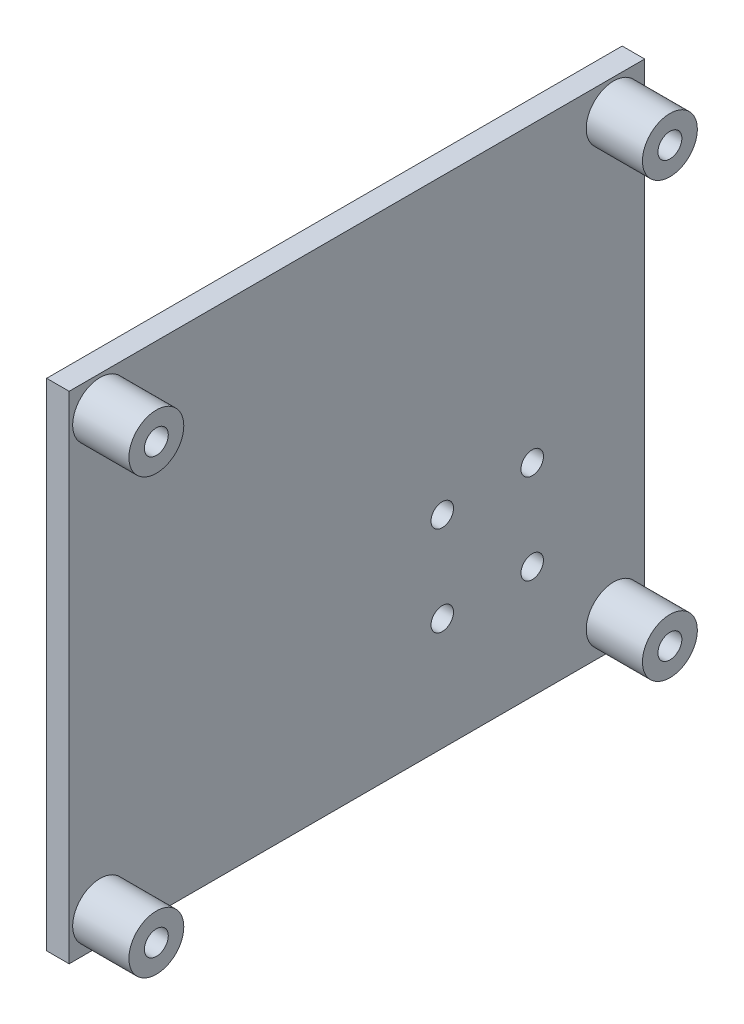
ISO-10303-21;
HEADER;
FILE_DESCRIPTION(('STEP AP214'),'2;1');
FILE_NAME('part.step','',(''),(''),'','','');
FILE_SCHEMA(('AUTOMOTIVE_DESIGN { 1 0 10303 214 1 1 1 1 }'));
ENDSEC;
DATA;
#1=APPLICATION_CONTEXT('core data for automotive mechanical design processes');
#2=APPLICATION_PROTOCOL_DEFINITION('international standard','automotive_design',2000,#1);
#3=PRODUCT_CONTEXT('',#1,'mechanical');
#4=PRODUCT('Part','Part','',(#3));
#5=PRODUCT_RELATED_PRODUCT_CATEGORY('part','',(#4));
#6=PRODUCT_DEFINITION_FORMATION('','',#4);
#7=PRODUCT_DEFINITION_CONTEXT('part definition',#1,'design');
#8=PRODUCT_DEFINITION('design','',#6,#7);
#9=PRODUCT_DEFINITION_SHAPE('','',#8);
#10=(LENGTH_UNIT() NAMED_UNIT(*) SI_UNIT(.MILLI.,.METRE.));
#11=(NAMED_UNIT(*) PLANE_ANGLE_UNIT() SI_UNIT($,.RADIAN.));
#12=(NAMED_UNIT(*) SI_UNIT($,.STERADIAN.) SOLID_ANGLE_UNIT());
#13=UNCERTAINTY_MEASURE_WITH_UNIT(LENGTH_MEASURE(1.E-05),#10,'distance_accuracy_value','');
#14=(GEOMETRIC_REPRESENTATION_CONTEXT(3) GLOBAL_UNCERTAINTY_ASSIGNED_CONTEXT((#13)) GLOBAL_UNIT_ASSIGNED_CONTEXT((#10,
#11,#12)) REPRESENTATION_CONTEXT('',''));
#15=CARTESIAN_POINT('',(0.,0.,0.));
#16=DIRECTION('',(0.,0.,1.));
#17=DIRECTION('',(1.,0.,0.));
#18=AXIS2_PLACEMENT_3D('',#15,#16,#17);
#19=CARTESIAN_POINT('',(2.54,94.3767908309456,336.103151862464));
#20=DIRECTION('',(0.,0.,-1.));
#21=DIRECTION('',(0.,1.,0.));
#22=AXIS2_PLACEMENT_3D('',#19,#20,#21);
#23=PLANE('',#22);
#24=DIRECTION('',(0.,-1.,0.));
#25=VECTOR('',#24,1.);
#26=CARTESIAN_POINT('',(0.,94.3767908309456,336.103151862464));
#27=LINE('',#26,#25);
#28=CARTESIAN_POINT('',(0.,94.3767908309456,336.103151862464));
#29=VERTEX_POINT('',#28);
#30=CARTESIAN_POINT('',(0.,38.3767908309455,336.103151862464));
#31=VERTEX_POINT('',#30);
#32=EDGE_CURVE('E100',#29,#31,#27,.T.);
#33=ORIENTED_EDGE('',*,*,#32,.T.);
#34=DIRECTION('',(-1.,0.,0.));
#35=VECTOR('',#34,1.);
#36=CARTESIAN_POINT('',(2.54,38.3767908309455,336.103151862464));
#37=LINE('',#36,#35);
#38=CARTESIAN_POINT('',(2.54,38.3767908309455,336.103151862464));
#39=VERTEX_POINT('',#38);
#40=EDGE_CURVE('E91',#39,#31,#37,.T.);
#41=ORIENTED_EDGE('',*,*,#40,.F.);
#42=DIRECTION('',(0.,-1.,0.));
#43=VECTOR('',#42,1.);
#44=CARTESIAN_POINT('',(2.54,94.3767908309456,336.103151862464));
#45=LINE('',#44,#43);
#46=CARTESIAN_POINT('',(2.54,94.3767908309456,336.103151862464));
#47=VERTEX_POINT('',#46);
#48=EDGE_CURVE('E85',#47,#39,#45,.T.);
#49=ORIENTED_EDGE('',*,*,#48,.F.);
#50=DIRECTION('',(-1.,0.,0.));
#51=VECTOR('',#50,1.);
#52=CARTESIAN_POINT('',(2.54,94.3767908309456,336.103151862464));
#53=LINE('',#52,#51);
#54=EDGE_CURVE('E96',#47,#29,#53,.T.);
#55=ORIENTED_EDGE('',*,*,#54,.T.);
#56=EDGE_LOOP('',(#33,#41,#49,#55));
#57=FACE_BOUND('',#56,.T.);
#58=ADVANCED_FACE('F33',(#57),#23,.F.);
#59=CARTESIAN_POINT('',(2.54,38.3767908309455,336.103151862464));
#60=DIRECTION('',(0.,1.,0.));
#61=DIRECTION('',(0.,0.,1.));
#62=AXIS2_PLACEMENT_3D('',#59,#60,#61);
#63=PLANE('',#62);
#64=DIRECTION('',(0.,0.,-1.));
#65=VECTOR('',#64,1.);
#66=CARTESIAN_POINT('',(0.,38.3767908309455,336.103151862464));
#67=LINE('',#66,#65);
#68=CARTESIAN_POINT('',(0.,38.3767908309456,271.103151862464));
#69=VERTEX_POINT('',#68);
#70=EDGE_CURVE('E90',#31,#69,#67,.T.);
#71=ORIENTED_EDGE('',*,*,#70,.T.);
#72=DIRECTION('',(-1.,0.,0.));
#73=VECTOR('',#72,1.);
#74=CARTESIAN_POINT('',(2.54,38.3767908309456,271.103151862464));
#75=LINE('',#74,#73);
#76=CARTESIAN_POINT('',(2.54,38.3767908309456,271.103151862464));
#77=VERTEX_POINT('',#76);
#78=EDGE_CURVE('E88',#77,#69,#75,.T.);
#79=ORIENTED_EDGE('',*,*,#78,.F.);
#80=DIRECTION('',(0.,0.,-1.));
#81=VECTOR('',#80,1.);
#82=CARTESIAN_POINT('',(2.54,38.3767908309455,336.103151862464));
#83=LINE('',#82,#81);
#84=EDGE_CURVE('E80',#39,#77,#83,.T.);
#85=ORIENTED_EDGE('',*,*,#84,.F.);
#86=ORIENTED_EDGE('',*,*,#40,.T.);
#87=EDGE_LOOP('',(#71,#79,#85,#86));
#88=FACE_BOUND('',#87,.T.);
#89=ADVANCED_FACE('F89',(#88),#63,.F.);
#90=CARTESIAN_POINT('',(2.54,94.3767908309456,271.103151862464));
#91=DIRECTION('',(0.,0.,1.));
#92=DIRECTION('',(1.,0.,0.));
#93=AXIS2_PLACEMENT_3D('',#90,#91,#92);
#94=PLANE('',#93);
#95=DIRECTION('',(0.,1.,0.));
#96=VECTOR('',#95,1.);
#97=CARTESIAN_POINT('',(0.,94.3767908309456,271.103151862464));
#98=LINE('',#97,#96);
#99=CARTESIAN_POINT('',(0.,94.3767908309456,271.103151862464));
#100=VERTEX_POINT('',#99);
#101=EDGE_CURVE('E66',#69,#100,#98,.T.);
#102=ORIENTED_EDGE('',*,*,#101,.T.);
#103=DIRECTION('',(-1.,0.,0.));
#104=VECTOR('',#103,1.);
#105=CARTESIAN_POINT('',(2.54,94.3767908309456,271.103151862464));
#106=LINE('',#105,#104);
#107=CARTESIAN_POINT('',(2.54,94.3767908309456,271.103151862464));
#108=VERTEX_POINT('',#107);
#109=EDGE_CURVE('E92',#108,#100,#106,.T.);
#110=ORIENTED_EDGE('',*,*,#109,.F.);
#111=DIRECTION('',(0.,1.,0.));
#112=VECTOR('',#111,1.);
#113=CARTESIAN_POINT('',(2.54,94.3767908309456,271.103151862464));
#114=LINE('',#113,#112);
#115=EDGE_CURVE('E83',#77,#108,#114,.T.);
#116=ORIENTED_EDGE('',*,*,#115,.F.);
#117=ORIENTED_EDGE('',*,*,#78,.T.);
#118=EDGE_LOOP('',(#102,#110,#116,#117));
#119=FACE_BOUND('',#118,.T.);
#120=ADVANCED_FACE('F94',(#119),#94,.F.);
#121=CARTESIAN_POINT('',(2.54,94.3767908309456,336.103151862464));
#122=DIRECTION('',(0.,-1.,0.));
#123=DIRECTION('',(0.,0.,-1.));
#124=AXIS2_PLACEMENT_3D('',#121,#122,#123);
#125=PLANE('',#124);
#126=DIRECTION('',(0.,0.,1.));
#127=VECTOR('',#126,1.);
#128=CARTESIAN_POINT('',(0.,94.3767908309456,336.103151862464));
#129=LINE('',#128,#127);
#130=EDGE_CURVE('E72',#100,#29,#129,.T.);
#131=ORIENTED_EDGE('',*,*,#130,.T.);
#132=ORIENTED_EDGE('',*,*,#54,.F.);
#133=DIRECTION('',(0.,0.,1.));
#134=VECTOR('',#133,1.);
#135=CARTESIAN_POINT('',(2.54,94.3767908309456,336.103151862464));
#136=LINE('',#135,#134);
#137=EDGE_CURVE('E49',#108,#47,#136,.T.);
#138=ORIENTED_EDGE('',*,*,#137,.F.);
#139=ORIENTED_EDGE('',*,*,#109,.T.);
#140=EDGE_LOOP('',(#131,#132,#138,#139));
#141=FACE_BOUND('',#140,.T.);
#142=ADVANCED_FACE('F132',(#141),#125,.F.);
#143=CARTESIAN_POINT('',(2.54,0.,0.));
#144=DIRECTION('',(1.,0.,0.));
#145=DIRECTION('',(0.,0.,-1.));
#146=AXIS2_PLACEMENT_3D('',#143,#144,#145);
#147=PLANE('',#146);
#148=CARTESIAN_POINT('',(2.54,51.0767908309455,293.963151862464));
#149=DIRECTION('',(1.,0.,0.));
#150=DIRECTION('',(0.,0.,-1.));
#151=AXIS2_PLACEMENT_3D('',#148,#149,#150);
#152=CIRCLE('',#151,1.26999999999998);
#153=CARTESIAN_POINT('',(2.54,51.0767908309455,292.693151862464));
#154=VERTEX_POINT('',#153);
#155=EDGE_CURVE('E422',#154,#154,#152,.T.);
#156=ORIENTED_EDGE('',*,*,#155,.F.);
#157=EDGE_LOOP('',(#156));
#158=FACE_BOUND('',#157,.T.);
#159=CARTESIAN_POINT('',(2.54,51.0767908309455,283.803151862464));
#160=DIRECTION('',(1.,0.,0.));
#161=DIRECTION('',(0.,0.,-1.));
#162=AXIS2_PLACEMENT_3D('',#159,#160,#161);
#163=CIRCLE('',#162,1.26999999999998);
#164=CARTESIAN_POINT('',(2.54,51.0767908309455,282.533151862464));
#165=VERTEX_POINT('',#164);
#166=EDGE_CURVE('E423',#165,#165,#163,.T.);
#167=ORIENTED_EDGE('',*,*,#166,.F.);
#168=EDGE_LOOP('',(#167));
#169=FACE_BOUND('',#168,.T.);
#170=CARTESIAN_POINT('',(2.54,61.2367908309455,293.963151862464));
#171=DIRECTION('',(1.,0.,0.));
#172=DIRECTION('',(0.,0.,-1.));
#173=AXIS2_PLACEMENT_3D('',#170,#171,#172);
#174=CIRCLE('',#173,1.26999999999998);
#175=CARTESIAN_POINT('',(2.54,61.2367908309455,292.693151862464));
#176=VERTEX_POINT('',#175);
#177=EDGE_CURVE('E426',#176,#176,#174,.T.);
#178=ORIENTED_EDGE('',*,*,#177,.F.);
#179=EDGE_LOOP('',(#178));
#180=FACE_BOUND('',#179,.T.);
#181=CARTESIAN_POINT('',(2.54,61.2367908309455,283.803151862464));
#182=DIRECTION('',(1.,0.,0.));
#183=DIRECTION('',(0.,0.,-1.));
#184=AXIS2_PLACEMENT_3D('',#181,#182,#183);
#185=CIRCLE('',#184,1.26999999999998);
#186=CARTESIAN_POINT('',(2.54,61.2367908309455,282.533151862464));
#187=VERTEX_POINT('',#186);
#188=EDGE_CURVE('E431',#187,#187,#185,.T.);
#189=ORIENTED_EDGE('',*,*,#188,.F.);
#190=EDGE_LOOP('',(#189));
#191=FACE_BOUND('',#190,.T.);
#192=CARTESIAN_POINT('',(2.54,41.8767908309455,332.603151862464));
#193=DIRECTION('',(1.,0.,0.));
#194=DIRECTION('',(0.,0.,-1.));
#195=AXIS2_PLACEMENT_3D('',#192,#193,#194);
#196=CIRCLE('',#195,3.09999999999999);
#197=CARTESIAN_POINT('',(2.54,41.8767908309455,329.503151862464));
#198=VERTEX_POINT('',#197);
#199=EDGE_CURVE('E471',#198,#198,#196,.T.);
#200=ORIENTED_EDGE('',*,*,#199,.F.);
#201=EDGE_LOOP('',(#200));
#202=FACE_BOUND('',#201,.T.);
#203=CARTESIAN_POINT('',(2.54,41.8767908309455,274.603151862464));
#204=DIRECTION('',(1.,0.,0.));
#205=DIRECTION('',(0.,0.,-1.));
#206=AXIS2_PLACEMENT_3D('',#203,#204,#205);
#207=CIRCLE('',#206,3.09999999999999);
#208=CARTESIAN_POINT('',(2.54,41.8767908309455,271.503151862464));
#209=VERTEX_POINT('',#208);
#210=EDGE_CURVE('E480',#209,#209,#207,.T.);
#211=ORIENTED_EDGE('',*,*,#210,.F.);
#212=EDGE_LOOP('',(#211));
#213=FACE_BOUND('',#212,.T.);
#214=CARTESIAN_POINT('',(2.54,90.8767908309455,274.603151862464));
#215=DIRECTION('',(1.,0.,0.));
#216=DIRECTION('',(0.,0.,-1.));
#217=AXIS2_PLACEMENT_3D('',#214,#215,#216);
#218=CIRCLE('',#217,3.09999999999999);
#219=CARTESIAN_POINT('',(2.54,90.8767908309455,271.503151862464));
#220=VERTEX_POINT('',#219);
#221=EDGE_CURVE('E489',#220,#220,#218,.T.);
#222=ORIENTED_EDGE('',*,*,#221,.F.);
#223=EDGE_LOOP('',(#222));
#224=FACE_BOUND('',#223,.T.);
#225=CARTESIAN_POINT('',(2.54,90.8767908309455,332.603151862464));
#226=DIRECTION('',(1.,0.,0.));
#227=DIRECTION('',(0.,0.,-1.));
#228=AXIS2_PLACEMENT_3D('',#225,#226,#227);
#229=CIRCLE('',#228,3.09999999999999);
#230=CARTESIAN_POINT('',(2.54,90.8767908309455,329.503151862464));
#231=VERTEX_POINT('',#230);
#232=EDGE_CURVE('E498',#231,#231,#229,.T.);
#233=ORIENTED_EDGE('',*,*,#232,.F.);
#234=EDGE_LOOP('',(#233));
#235=FACE_BOUND('',#234,.T.);
#236=ORIENTED_EDGE('',*,*,#48,.T.);
#237=ORIENTED_EDGE('',*,*,#84,.T.);
#238=ORIENTED_EDGE('',*,*,#115,.T.);
#239=ORIENTED_EDGE('',*,*,#137,.T.);
#240=EDGE_LOOP('',(#236,#237,#238,#239));
#241=FACE_BOUND('',#240,.T.);
#242=ADVANCED_FACE('F81',(#158,#169,#180,#191,#202,#213,#224,#235,#241),#147,.T.);
#243=CARTESIAN_POINT('',(0.,0.,0.));
#244=DIRECTION('',(1.,0.,0.));
#245=DIRECTION('',(0.,0.,-1.));
#246=AXIS2_PLACEMENT_3D('',#243,#244,#245);
#247=PLANE('',#246);
#248=CARTESIAN_POINT('',(0.,41.8767908309455,332.603151862464));
#249=DIRECTION('',(1.,0.,0.));
#250=DIRECTION('',(0.,0.,-1.));
#251=AXIS2_PLACEMENT_3D('',#248,#249,#250);
#252=CIRCLE('',#251,1.35000000000001);
#253=CARTESIAN_POINT('',(0.,41.8767908309455,331.253151862464));
#254=VERTEX_POINT('',#253);
#255=EDGE_CURVE('E434',#254,#254,#252,.T.);
#256=ORIENTED_EDGE('',*,*,#255,.T.);
#257=EDGE_LOOP('',(#256));
#258=FACE_BOUND('',#257,.T.);
#259=CARTESIAN_POINT('',(0.,41.8767908309455,274.603151862464));
#260=DIRECTION('',(1.,0.,0.));
#261=DIRECTION('',(0.,0.,-1.));
#262=AXIS2_PLACEMENT_3D('',#259,#260,#261);
#263=CIRCLE('',#262,1.35000000000001);
#264=CARTESIAN_POINT('',(0.,41.8767908309455,273.253151862464));
#265=VERTEX_POINT('',#264);
#266=EDGE_CURVE('E437',#265,#265,#263,.T.);
#267=ORIENTED_EDGE('',*,*,#266,.T.);
#268=EDGE_LOOP('',(#267));
#269=FACE_BOUND('',#268,.T.);
#270=CARTESIAN_POINT('',(0.,90.8767908309455,274.603151862464));
#271=DIRECTION('',(1.,0.,0.));
#272=DIRECTION('',(0.,0.,-1.));
#273=AXIS2_PLACEMENT_3D('',#270,#271,#272);
#274=CIRCLE('',#273,1.35000000000001);
#275=CARTESIAN_POINT('',(0.,90.8767908309455,273.253151862464));
#276=VERTEX_POINT('',#275);
#277=EDGE_CURVE('E440',#276,#276,#274,.T.);
#278=ORIENTED_EDGE('',*,*,#277,.T.);
#279=EDGE_LOOP('',(#278));
#280=FACE_BOUND('',#279,.T.);
#281=CARTESIAN_POINT('',(0.,90.8767908309455,332.603151862464));
#282=DIRECTION('',(1.,0.,0.));
#283=DIRECTION('',(0.,0.,-1.));
#284=AXIS2_PLACEMENT_3D('',#281,#282,#283);
#285=CIRCLE('',#284,1.34999996700003);
#286=CARTESIAN_POINT('',(0.,90.8767908309455,331.253151895464));
#287=VERTEX_POINT('',#286);
#288=EDGE_CURVE('E443',#287,#287,#285,.T.);
#289=ORIENTED_EDGE('',*,*,#288,.T.);
#290=EDGE_LOOP('',(#289));
#291=FACE_BOUND('',#290,.T.);
#292=CARTESIAN_POINT('',(0.,51.0767908309455,293.963151862464));
#293=DIRECTION('',(1.,0.,0.));
#294=DIRECTION('',(0.,0.,-1.));
#295=AXIS2_PLACEMENT_3D('',#292,#293,#294);
#296=CIRCLE('',#295,2.54000000000001);
#297=CARTESIAN_POINT('',(0.,51.0767908309455,291.423151862464));
#298=VERTEX_POINT('',#297);
#299=EDGE_CURVE('E11',#298,#298,#296,.F.);
#300=ORIENTED_EDGE('',*,*,#299,.F.);
#301=EDGE_LOOP('',(#300));
#302=FACE_BOUND('',#301,.T.);
#303=CARTESIAN_POINT('',(0.,51.0767908309455,283.803151862464));
#304=DIRECTION('',(1.,0.,0.));
#305=DIRECTION('',(0.,0.,-1.));
#306=AXIS2_PLACEMENT_3D('',#303,#304,#305);
#307=CIRCLE('',#306,2.54000000000001);
#308=CARTESIAN_POINT('',(0.,51.0767908309455,281.263151862464));
#309=VERTEX_POINT('',#308);
#310=EDGE_CURVE('E41',#309,#309,#307,.F.);
#311=ORIENTED_EDGE('',*,*,#310,.F.);
#312=EDGE_LOOP('',(#311));
#313=FACE_BOUND('',#312,.T.);
#314=CARTESIAN_POINT('',(0.,61.2367908309455,293.963151862464));
#315=DIRECTION('',(1.,0.,0.));
#316=DIRECTION('',(0.,0.,-1.));
#317=AXIS2_PLACEMENT_3D('',#314,#315,#316);
#318=CIRCLE('',#317,2.54000000000001);
#319=CARTESIAN_POINT('',(0.,61.2367908309455,291.423151862464));
#320=VERTEX_POINT('',#319);
#321=EDGE_CURVE('E113',#320,#320,#318,.F.);
#322=ORIENTED_EDGE('',*,*,#321,.F.);
#323=EDGE_LOOP('',(#322));
#324=FACE_BOUND('',#323,.T.);
#325=CARTESIAN_POINT('',(0.,61.2367908309455,283.803151862464));
#326=DIRECTION('',(1.,0.,0.));
#327=DIRECTION('',(0.,0.,-1.));
#328=AXIS2_PLACEMENT_3D('',#325,#326,#327);
#329=CIRCLE('',#328,2.54000000000001);
#330=CARTESIAN_POINT('',(0.,61.2367908309455,281.263151862464));
#331=VERTEX_POINT('',#330);
#332=EDGE_CURVE('E110',#331,#331,#329,.F.);
#333=ORIENTED_EDGE('',*,*,#332,.F.);
#334=EDGE_LOOP('',(#333));
#335=FACE_BOUND('',#334,.T.);
#336=ORIENTED_EDGE('',*,*,#32,.F.);
#337=ORIENTED_EDGE('',*,*,#130,.F.);
#338=ORIENTED_EDGE('',*,*,#101,.F.);
#339=ORIENTED_EDGE('',*,*,#70,.F.);
#340=EDGE_LOOP('',(#336,#337,#338,#339));
#341=FACE_BOUND('',#340,.T.);
#342=ADVANCED_FACE('F120',(#258,#269,#280,#291,#302,#313,#324,#335,#341),#247,.F.);
#343=CARTESIAN_POINT('',(8.89,90.8767908309455,332.603151862464));
#344=DIRECTION('',(1.,0.,0.));
#345=DIRECTION('',(0.,0.,-1.));
#346=AXIS2_PLACEMENT_3D('',#343,#344,#345);
#347=PLANE('',#346);
#348=CARTESIAN_POINT('',(8.89,90.8767908309455,332.603151862464));
#349=DIRECTION('',(1.,0.,0.));
#350=DIRECTION('',(0.,0.,-1.));
#351=AXIS2_PLACEMENT_3D('',#348,#349,#350);
#352=CIRCLE('',#351,3.09999999999999);
#353=CARTESIAN_POINT('',(8.89,90.8767908309455,329.503151862464));
#354=VERTEX_POINT('',#353);
#355=EDGE_CURVE('E103',#354,#354,#352,.T.);
#356=ORIENTED_EDGE('',*,*,#355,.T.);
#357=EDGE_LOOP('',(#356));
#358=FACE_BOUND('',#357,.T.);
#359=CARTESIAN_POINT('',(8.89,90.8767908309455,332.603151862464));
#360=DIRECTION('',(1.,0.,0.));
#361=DIRECTION('',(0.,0.,-1.));
#362=AXIS2_PLACEMENT_3D('',#359,#360,#361);
#363=CIRCLE('',#362,1.34999996700003);
#364=CARTESIAN_POINT('',(8.89,90.8767908309455,331.253151895464));
#365=VERTEX_POINT('',#364);
#366=EDGE_CURVE('E493',#365,#365,#363,.T.);
#367=ORIENTED_EDGE('',*,*,#366,.F.);
#368=EDGE_LOOP('',(#367));
#369=FACE_BOUND('',#368,.T.);
#370=ADVANCED_FACE('F123',(#358,#369),#347,.T.);
#371=CARTESIAN_POINT('',(8.89,90.8767908309455,332.603151862464));
#372=DIRECTION('',(-1.,0.,0.));
#373=DIRECTION('',(0.,0.,1.));
#374=AXIS2_PLACEMENT_3D('',#371,#372,#373);
#375=CYLINDRICAL_SURFACE('',#374,3.09999999999999);
#376=ORIENTED_EDGE('',*,*,#355,.F.);
#377=EDGE_LOOP('',(#376));
#378=FACE_BOUND('',#377,.T.);
#379=ORIENTED_EDGE('',*,*,#232,.T.);
#380=EDGE_LOOP('',(#379));
#381=FACE_BOUND('',#380,.T.);
#382=ADVANCED_FACE('F167',(#378,#381),#375,.T.);
#383=CARTESIAN_POINT('',(8.89,90.8767908309455,332.603151862464));
#384=DIRECTION('',(-1.,0.,0.));
#385=DIRECTION('',(0.,0.,1.));
#386=AXIS2_PLACEMENT_3D('',#383,#384,#385);
#387=CYLINDRICAL_SURFACE('',#386,1.34999996700003);
#388=ORIENTED_EDGE('',*,*,#366,.T.);
#389=EDGE_LOOP('',(#388));
#390=FACE_BOUND('',#389,.T.);
#391=ORIENTED_EDGE('',*,*,#288,.F.);
#392=EDGE_LOOP('',(#391));
#393=FACE_BOUND('',#392,.T.);
#394=ADVANCED_FACE('F179',(#390,#393),#387,.F.);
#395=CARTESIAN_POINT('',(8.89,90.8767908309455,274.603151862464));
#396=DIRECTION('',(1.,0.,0.));
#397=DIRECTION('',(0.,0.,-1.));
#398=AXIS2_PLACEMENT_3D('',#395,#396,#397);
#399=PLANE('',#398);
#400=CARTESIAN_POINT('',(8.89,90.8767908309455,274.603151862464));
#401=DIRECTION('',(1.,0.,0.));
#402=DIRECTION('',(0.,0.,-1.));
#403=AXIS2_PLACEMENT_3D('',#400,#401,#402);
#404=CIRCLE('',#403,3.09999999999999);
#405=CARTESIAN_POINT('',(8.89,90.8767908309455,271.503151862464));
#406=VERTEX_POINT('',#405);
#407=EDGE_CURVE('E490',#406,#406,#404,.T.);
#408=ORIENTED_EDGE('',*,*,#407,.T.);
#409=EDGE_LOOP('',(#408));
#410=FACE_BOUND('',#409,.T.);
#411=CARTESIAN_POINT('',(8.89,90.8767908309455,274.603151862464));
#412=DIRECTION('',(1.,0.,0.));
#413=DIRECTION('',(0.,0.,-1.));
#414=AXIS2_PLACEMENT_3D('',#411,#412,#413);
#415=CIRCLE('',#414,1.35000000000001);
#416=CARTESIAN_POINT('',(8.89,90.8767908309455,273.253151862464));
#417=VERTEX_POINT('',#416);
#418=EDGE_CURVE('E484',#417,#417,#415,.T.);
#419=ORIENTED_EDGE('',*,*,#418,.F.);
#420=EDGE_LOOP('',(#419));
#421=FACE_BOUND('',#420,.T.);
#422=ADVANCED_FACE('F187',(#410,#421),#399,.T.);
#423=CARTESIAN_POINT('',(8.89,90.8767908309455,274.603151862464));
#424=DIRECTION('',(-1.,0.,0.));
#425=DIRECTION('',(0.,0.,1.));
#426=AXIS2_PLACEMENT_3D('',#423,#424,#425);
#427=CYLINDRICAL_SURFACE('',#426,3.09999999999999);
#428=ORIENTED_EDGE('',*,*,#407,.F.);
#429=EDGE_LOOP('',(#428));
#430=FACE_BOUND('',#429,.T.);
#431=ORIENTED_EDGE('',*,*,#221,.T.);
#432=EDGE_LOOP('',(#431));
#433=FACE_BOUND('',#432,.T.);
#434=ADVANCED_FACE('F191',(#430,#433),#427,.T.);
#435=CARTESIAN_POINT('',(8.89,90.8767908309455,274.603151862464));
#436=DIRECTION('',(-1.,0.,0.));
#437=DIRECTION('',(0.,0.,1.));
#438=AXIS2_PLACEMENT_3D('',#435,#436,#437);
#439=CYLINDRICAL_SURFACE('',#438,1.35000000000001);
#440=ORIENTED_EDGE('',*,*,#418,.T.);
#441=EDGE_LOOP('',(#440));
#442=FACE_BOUND('',#441,.T.);
#443=ORIENTED_EDGE('',*,*,#277,.F.);
#444=EDGE_LOOP('',(#443));
#445=FACE_BOUND('',#444,.T.);
#446=ADVANCED_FACE('F201',(#442,#445),#439,.F.);
#447=CARTESIAN_POINT('',(8.89,41.8767908309455,274.603151862464));
#448=DIRECTION('',(1.,0.,0.));
#449=DIRECTION('',(0.,0.,-1.));
#450=AXIS2_PLACEMENT_3D('',#447,#448,#449);
#451=PLANE('',#450);
#452=CARTESIAN_POINT('',(8.89,41.8767908309455,274.603151862464));
#453=DIRECTION('',(1.,0.,0.));
#454=DIRECTION('',(0.,0.,-1.));
#455=AXIS2_PLACEMENT_3D('',#452,#453,#454);
#456=CIRCLE('',#455,3.09999999999999);
#457=CARTESIAN_POINT('',(8.89,41.8767908309455,271.503151862464));
#458=VERTEX_POINT('',#457);
#459=EDGE_CURVE('E481',#458,#458,#456,.T.);
#460=ORIENTED_EDGE('',*,*,#459,.T.);
#461=EDGE_LOOP('',(#460));
#462=FACE_BOUND('',#461,.T.);
#463=CARTESIAN_POINT('',(8.89,41.8767908309455,274.603151862464));
#464=DIRECTION('',(1.,0.,0.));
#465=DIRECTION('',(0.,0.,-1.));
#466=AXIS2_PLACEMENT_3D('',#463,#464,#465);
#467=CIRCLE('',#466,1.35000000000001);
#468=CARTESIAN_POINT('',(8.89,41.8767908309455,273.253151862464));
#469=VERTEX_POINT('',#468);
#470=EDGE_CURVE('E475',#469,#469,#467,.T.);
#471=ORIENTED_EDGE('',*,*,#470,.F.);
#472=EDGE_LOOP('',(#471));
#473=FACE_BOUND('',#472,.T.);
#474=ADVANCED_FACE('F209',(#462,#473),#451,.T.);
#475=CARTESIAN_POINT('',(8.89,41.8767908309455,274.603151862464));
#476=DIRECTION('',(-1.,0.,0.));
#477=DIRECTION('',(0.,0.,1.));
#478=AXIS2_PLACEMENT_3D('',#475,#476,#477);
#479=CYLINDRICAL_SURFACE('',#478,3.09999999999999);
#480=ORIENTED_EDGE('',*,*,#459,.F.);
#481=EDGE_LOOP('',(#480));
#482=FACE_BOUND('',#481,.T.);
#483=ORIENTED_EDGE('',*,*,#210,.T.);
#484=EDGE_LOOP('',(#483));
#485=FACE_BOUND('',#484,.T.);
#486=ADVANCED_FACE('F213',(#482,#485),#479,.T.);
#487=CARTESIAN_POINT('',(8.89,41.8767908309455,274.603151862464));
#488=DIRECTION('',(-1.,0.,0.));
#489=DIRECTION('',(0.,0.,1.));
#490=AXIS2_PLACEMENT_3D('',#487,#488,#489);
#491=CYLINDRICAL_SURFACE('',#490,1.35000000000001);
#492=ORIENTED_EDGE('',*,*,#470,.T.);
#493=EDGE_LOOP('',(#492));
#494=FACE_BOUND('',#493,.T.);
#495=ORIENTED_EDGE('',*,*,#266,.F.);
#496=EDGE_LOOP('',(#495));
#497=FACE_BOUND('',#496,.T.);
#498=ADVANCED_FACE('F223',(#494,#497),#491,.F.);
#499=CARTESIAN_POINT('',(8.89,41.8767908309455,332.603151862464));
#500=DIRECTION('',(1.,0.,0.));
#501=DIRECTION('',(0.,0.,-1.));
#502=AXIS2_PLACEMENT_3D('',#499,#500,#501);
#503=PLANE('',#502);
#504=CARTESIAN_POINT('',(8.89,41.8767908309455,332.603151862464));
#505=DIRECTION('',(1.,0.,0.));
#506=DIRECTION('',(0.,0.,-1.));
#507=AXIS2_PLACEMENT_3D('',#504,#505,#506);
#508=CIRCLE('',#507,3.09999999999999);
#509=CARTESIAN_POINT('',(8.89,41.8767908309455,329.503151862464));
#510=VERTEX_POINT('',#509);
#511=EDGE_CURVE('E472',#510,#510,#508,.T.);
#512=ORIENTED_EDGE('',*,*,#511,.T.);
#513=EDGE_LOOP('',(#512));
#514=FACE_BOUND('',#513,.T.);
#515=CARTESIAN_POINT('',(8.89,41.8767908309455,332.603151862464));
#516=DIRECTION('',(1.,0.,0.));
#517=DIRECTION('',(0.,0.,-1.));
#518=AXIS2_PLACEMENT_3D('',#515,#516,#517);
#519=CIRCLE('',#518,1.35000000000001);
#520=CARTESIAN_POINT('',(8.89,41.8767908309455,331.253151862464));
#521=VERTEX_POINT('',#520);
#522=EDGE_CURVE('E468',#521,#521,#519,.T.);
#523=ORIENTED_EDGE('',*,*,#522,.F.);
#524=EDGE_LOOP('',(#523));
#525=FACE_BOUND('',#524,.T.);
#526=ADVANCED_FACE('F231',(#514,#525),#503,.T.);
#527=CARTESIAN_POINT('',(8.89,41.8767908309455,332.603151862464));
#528=DIRECTION('',(-1.,0.,0.));
#529=DIRECTION('',(0.,0.,1.));
#530=AXIS2_PLACEMENT_3D('',#527,#528,#529);
#531=CYLINDRICAL_SURFACE('',#530,3.09999999999999);
#532=ORIENTED_EDGE('',*,*,#511,.F.);
#533=EDGE_LOOP('',(#532));
#534=FACE_BOUND('',#533,.T.);
#535=ORIENTED_EDGE('',*,*,#199,.T.);
#536=EDGE_LOOP('',(#535));
#537=FACE_BOUND('',#536,.T.);
#538=ADVANCED_FACE('F235',(#534,#537),#531,.T.);
#539=CARTESIAN_POINT('',(8.89,41.8767908309455,332.603151862464));
#540=DIRECTION('',(-1.,0.,0.));
#541=DIRECTION('',(0.,0.,1.));
#542=AXIS2_PLACEMENT_3D('',#539,#540,#541);
#543=CYLINDRICAL_SURFACE('',#542,1.35000000000001);
#544=ORIENTED_EDGE('',*,*,#522,.T.);
#545=EDGE_LOOP('',(#544));
#546=FACE_BOUND('',#545,.T.);
#547=ORIENTED_EDGE('',*,*,#255,.F.);
#548=EDGE_LOOP('',(#547));
#549=FACE_BOUND('',#548,.T.);
#550=ADVANCED_FACE('F245',(#546,#549),#543,.F.);
#551=CARTESIAN_POINT('',(-6.35,61.2367908309455,283.803151862464));
#552=DIRECTION('',(-1.,0.,0.));
#553=DIRECTION('',(0.,0.,1.));
#554=AXIS2_PLACEMENT_3D('',#551,#552,#553);
#555=PLANE('',#554);
#556=CARTESIAN_POINT('',(-6.35,61.2367908309455,283.803151862464));
#557=DIRECTION('',(-1.,0.,0.));
#558=DIRECTION('',(0.,0.,1.));
#559=AXIS2_PLACEMENT_3D('',#556,#557,#558);
#560=CIRCLE('',#559,2.54000000000001);
#561=CARTESIAN_POINT('',(-6.35,61.2367908309455,286.343151862464));
#562=VERTEX_POINT('',#561);
#563=EDGE_CURVE('E465',#562,#562,#560,.T.);
#564=ORIENTED_EDGE('',*,*,#563,.T.);
#565=EDGE_LOOP('',(#564));
#566=FACE_BOUND('',#565,.T.);
#567=CARTESIAN_POINT('',(-6.35,61.2367908309455,283.803151862464));
#568=DIRECTION('',(-1.,0.,0.));
#569=DIRECTION('',(0.,0.,1.));
#570=AXIS2_PLACEMENT_3D('',#567,#568,#569);
#571=CIRCLE('',#570,1.26999999999998);
#572=CARTESIAN_POINT('',(-6.35,61.2367908309455,285.073151862464));
#573=VERTEX_POINT('',#572);
#574=EDGE_CURVE('E462',#573,#573,#571,.T.);
#575=ORIENTED_EDGE('',*,*,#574,.F.);
#576=EDGE_LOOP('',(#575));
#577=FACE_BOUND('',#576,.T.);
#578=ADVANCED_FACE('F253',(#566,#577),#555,.T.);
#579=CARTESIAN_POINT('',(-6.35,61.2367908309455,283.803151862464));
#580=DIRECTION('',(1.,0.,0.));
#581=DIRECTION('',(0.,0.,-1.));
#582=AXIS2_PLACEMENT_3D('',#579,#580,#581);
#583=CYLINDRICAL_SURFACE('',#582,2.54000000000001);
#584=ORIENTED_EDGE('',*,*,#563,.F.);
#585=EDGE_LOOP('',(#584));
#586=FACE_BOUND('',#585,.T.);
#587=ORIENTED_EDGE('',*,*,#332,.T.);
#588=EDGE_LOOP('',(#587));
#589=FACE_BOUND('',#588,.T.);
#590=ADVANCED_FACE('F258',(#586,#589),#583,.T.);
#591=CARTESIAN_POINT('',(-6.35,61.2367908309455,283.803151862464));
#592=DIRECTION('',(1.,0.,0.));
#593=DIRECTION('',(0.,0.,-1.));
#594=AXIS2_PLACEMENT_3D('',#591,#592,#593);
#595=CYLINDRICAL_SURFACE('',#594,1.26999999999998);
#596=ORIENTED_EDGE('',*,*,#574,.T.);
#597=EDGE_LOOP('',(#596));
#598=FACE_BOUND('',#597,.T.);
#599=ORIENTED_EDGE('',*,*,#188,.T.);
#600=EDGE_LOOP('',(#599));
#601=FACE_BOUND('',#600,.T.);
#602=ADVANCED_FACE('F269',(#598,#601),#595,.F.);
#603=CARTESIAN_POINT('',(-6.35,61.2367908309455,293.963151862464));
#604=DIRECTION('',(-1.,0.,0.));
#605=DIRECTION('',(0.,0.,1.));
#606=AXIS2_PLACEMENT_3D('',#603,#604,#605);
#607=PLANE('',#606);
#608=CARTESIAN_POINT('',(-6.35,61.2367908309455,293.963151862464));
#609=DIRECTION('',(-1.,0.,0.));
#610=DIRECTION('',(0.,0.,1.));
#611=AXIS2_PLACEMENT_3D('',#608,#609,#610);
#612=CIRCLE('',#611,2.54000000000001);
#613=CARTESIAN_POINT('',(-6.35,61.2367908309455,296.503151862464));
#614=VERTEX_POINT('',#613);
#615=EDGE_CURVE('E459',#614,#614,#612,.T.);
#616=ORIENTED_EDGE('',*,*,#615,.T.);
#617=EDGE_LOOP('',(#616));
#618=FACE_BOUND('',#617,.T.);
#619=CARTESIAN_POINT('',(-6.35,61.2367908309455,293.963151862464));
#620=DIRECTION('',(-1.,0.,0.));
#621=DIRECTION('',(0.,0.,1.));
#622=AXIS2_PLACEMENT_3D('',#619,#620,#621);
#623=CIRCLE('',#622,1.26999999999998);
#624=CARTESIAN_POINT('',(-6.35,61.2367908309455,295.233151862464));
#625=VERTEX_POINT('',#624);
#626=EDGE_CURVE('E456',#625,#625,#623,.T.);
#627=ORIENTED_EDGE('',*,*,#626,.F.);
#628=EDGE_LOOP('',(#627));
#629=FACE_BOUND('',#628,.T.);
#630=ADVANCED_FACE('F277',(#618,#629),#607,.T.);
#631=CARTESIAN_POINT('',(-6.35,61.2367908309455,293.963151862464));
#632=DIRECTION('',(1.,0.,0.));
#633=DIRECTION('',(0.,0.,-1.));
#634=AXIS2_PLACEMENT_3D('',#631,#632,#633);
#635=CYLINDRICAL_SURFACE('',#634,2.54000000000001);
#636=ORIENTED_EDGE('',*,*,#615,.F.);
#637=EDGE_LOOP('',(#636));
#638=FACE_BOUND('',#637,.T.);
#639=ORIENTED_EDGE('',*,*,#321,.T.);
#640=EDGE_LOOP('',(#639));
#641=FACE_BOUND('',#640,.T.);
#642=ADVANCED_FACE('F282',(#638,#641),#635,.T.);
#643=CARTESIAN_POINT('',(-6.35,61.2367908309455,293.963151862464));
#644=DIRECTION('',(1.,0.,0.));
#645=DIRECTION('',(0.,0.,-1.));
#646=AXIS2_PLACEMENT_3D('',#643,#644,#645);
#647=CYLINDRICAL_SURFACE('',#646,1.26999999999998);
#648=ORIENTED_EDGE('',*,*,#626,.T.);
#649=EDGE_LOOP('',(#648));
#650=FACE_BOUND('',#649,.T.);
#651=ORIENTED_EDGE('',*,*,#177,.T.);
#652=EDGE_LOOP('',(#651));
#653=FACE_BOUND('',#652,.T.);
#654=ADVANCED_FACE('F292',(#650,#653),#647,.F.);
#655=CARTESIAN_POINT('',(-6.35,51.0767908309455,283.803151862464));
#656=DIRECTION('',(-1.,0.,0.));
#657=DIRECTION('',(0.,0.,1.));
#658=AXIS2_PLACEMENT_3D('',#655,#656,#657);
#659=PLANE('',#658);
#660=CARTESIAN_POINT('',(-6.35,51.0767908309455,283.803151862464));
#661=DIRECTION('',(-1.,0.,0.));
#662=DIRECTION('',(0.,0.,1.));
#663=AXIS2_PLACEMENT_3D('',#660,#661,#662);
#664=CIRCLE('',#663,2.54000000000001);
#665=CARTESIAN_POINT('',(-6.35,51.0767908309455,286.343151862464));
#666=VERTEX_POINT('',#665);
#667=EDGE_CURVE('E453',#666,#666,#664,.T.);
#668=ORIENTED_EDGE('',*,*,#667,.T.);
#669=EDGE_LOOP('',(#668));
#670=FACE_BOUND('',#669,.T.);
#671=CARTESIAN_POINT('',(-6.35,51.0767908309455,283.803151862464));
#672=DIRECTION('',(-1.,0.,0.));
#673=DIRECTION('',(0.,0.,1.));
#674=AXIS2_PLACEMENT_3D('',#671,#672,#673);
#675=CIRCLE('',#674,1.26999999999998);
#676=CARTESIAN_POINT('',(-6.35,51.0767908309455,285.073151862464));
#677=VERTEX_POINT('',#676);
#678=EDGE_CURVE('E450',#677,#677,#675,.T.);
#679=ORIENTED_EDGE('',*,*,#678,.F.);
#680=EDGE_LOOP('',(#679));
#681=FACE_BOUND('',#680,.T.);
#682=ADVANCED_FACE('F300',(#670,#681),#659,.T.);
#683=CARTESIAN_POINT('',(-6.35,51.0767908309455,283.803151862464));
#684=DIRECTION('',(1.,0.,0.));
#685=DIRECTION('',(0.,0.,-1.));
#686=AXIS2_PLACEMENT_3D('',#683,#684,#685);
#687=CYLINDRICAL_SURFACE('',#686,2.54000000000001);
#688=ORIENTED_EDGE('',*,*,#667,.F.);
#689=EDGE_LOOP('',(#688));
#690=FACE_BOUND('',#689,.T.);
#691=ORIENTED_EDGE('',*,*,#310,.T.);
#692=EDGE_LOOP('',(#691));
#693=FACE_BOUND('',#692,.T.);
#694=ADVANCED_FACE('F118',(#690,#693),#687,.T.);
#695=CARTESIAN_POINT('',(-6.35,51.0767908309455,283.803151862464));
#696=DIRECTION('',(1.,0.,0.));
#697=DIRECTION('',(0.,0.,-1.));
#698=AXIS2_PLACEMENT_3D('',#695,#696,#697);
#699=CYLINDRICAL_SURFACE('',#698,1.26999999999998);
#700=ORIENTED_EDGE('',*,*,#678,.T.);
#701=EDGE_LOOP('',(#700));
#702=FACE_BOUND('',#701,.T.);
#703=ORIENTED_EDGE('',*,*,#166,.T.);
#704=EDGE_LOOP('',(#703));
#705=FACE_BOUND('',#704,.T.);
#706=ADVANCED_FACE('F314',(#702,#705),#699,.F.);
#707=CARTESIAN_POINT('',(-6.35,51.0767908309455,293.963151862464));
#708=DIRECTION('',(-1.,0.,0.));
#709=DIRECTION('',(0.,0.,1.));
#710=AXIS2_PLACEMENT_3D('',#707,#708,#709);
#711=PLANE('',#710);
#712=CARTESIAN_POINT('',(-6.35,51.0767908309455,293.963151862464));
#713=DIRECTION('',(-1.,0.,0.));
#714=DIRECTION('',(0.,0.,1.));
#715=AXIS2_PLACEMENT_3D('',#712,#713,#714);
#716=CIRCLE('',#715,2.54000000000001);
#717=CARTESIAN_POINT('',(-6.35,51.0767908309455,296.503151862464));
#718=VERTEX_POINT('',#717);
#719=EDGE_CURVE('E447',#718,#718,#716,.T.);
#720=ORIENTED_EDGE('',*,*,#719,.T.);
#721=EDGE_LOOP('',(#720));
#722=FACE_BOUND('',#721,.T.);
#723=CARTESIAN_POINT('',(-6.35,51.0767908309455,293.963151862464));
#724=DIRECTION('',(-1.,0.,0.));
#725=DIRECTION('',(0.,0.,1.));
#726=AXIS2_PLACEMENT_3D('',#723,#724,#725);
#727=CIRCLE('',#726,1.26999999999998);
#728=CARTESIAN_POINT('',(-6.35,51.0767908309455,295.233151862464));
#729=VERTEX_POINT('',#728);
#730=EDGE_CURVE('E419',#729,#729,#727,.T.);
#731=ORIENTED_EDGE('',*,*,#730,.F.);
#732=EDGE_LOOP('',(#731));
#733=FACE_BOUND('',#732,.T.);
#734=ADVANCED_FACE('F322',(#722,#733),#711,.T.);
#735=CARTESIAN_POINT('',(-6.35,51.0767908309455,293.963151862464));
#736=DIRECTION('',(1.,0.,0.));
#737=DIRECTION('',(0.,0.,-1.));
#738=AXIS2_PLACEMENT_3D('',#735,#736,#737);
#739=CYLINDRICAL_SURFACE('',#738,2.54000000000001);
#740=ORIENTED_EDGE('',*,*,#719,.F.);
#741=EDGE_LOOP('',(#740));
#742=FACE_BOUND('',#741,.T.);
#743=ORIENTED_EDGE('',*,*,#299,.T.);
#744=EDGE_LOOP('',(#743));
#745=FACE_BOUND('',#744,.T.);
#746=ADVANCED_FACE('F327',(#742,#745),#739,.T.);
#747=CARTESIAN_POINT('',(-6.35,51.0767908309455,293.963151862464));
#748=DIRECTION('',(1.,0.,0.));
#749=DIRECTION('',(0.,0.,-1.));
#750=AXIS2_PLACEMENT_3D('',#747,#748,#749);
#751=CYLINDRICAL_SURFACE('',#750,1.26999999999998);
#752=ORIENTED_EDGE('',*,*,#730,.T.);
#753=EDGE_LOOP('',(#752));
#754=FACE_BOUND('',#753,.T.);
#755=ORIENTED_EDGE('',*,*,#155,.T.);
#756=EDGE_LOOP('',(#755));
#757=FACE_BOUND('',#756,.T.);
#758=ADVANCED_FACE('F336',(#754,#757),#751,.F.);
#759=CLOSED_SHELL('',(#58,#89,#120,#142,#242,#342,#370,#382,#394,#422,#434,#446,#474,#486,#498,
#526,#538,#550,#578,#590,#602,#630,#642,#654,#682,#694,#706,#734,#746,#758));
#760=MANIFOLD_SOLID_BREP('B2',#759);
#761=ADVANCED_BREP_SHAPE_REPRESENTATION('',(#18,#760),#14);
#762=SHAPE_DEFINITION_REPRESENTATION(#9,#761);
ENDSEC;
END-ISO-10303-21;
